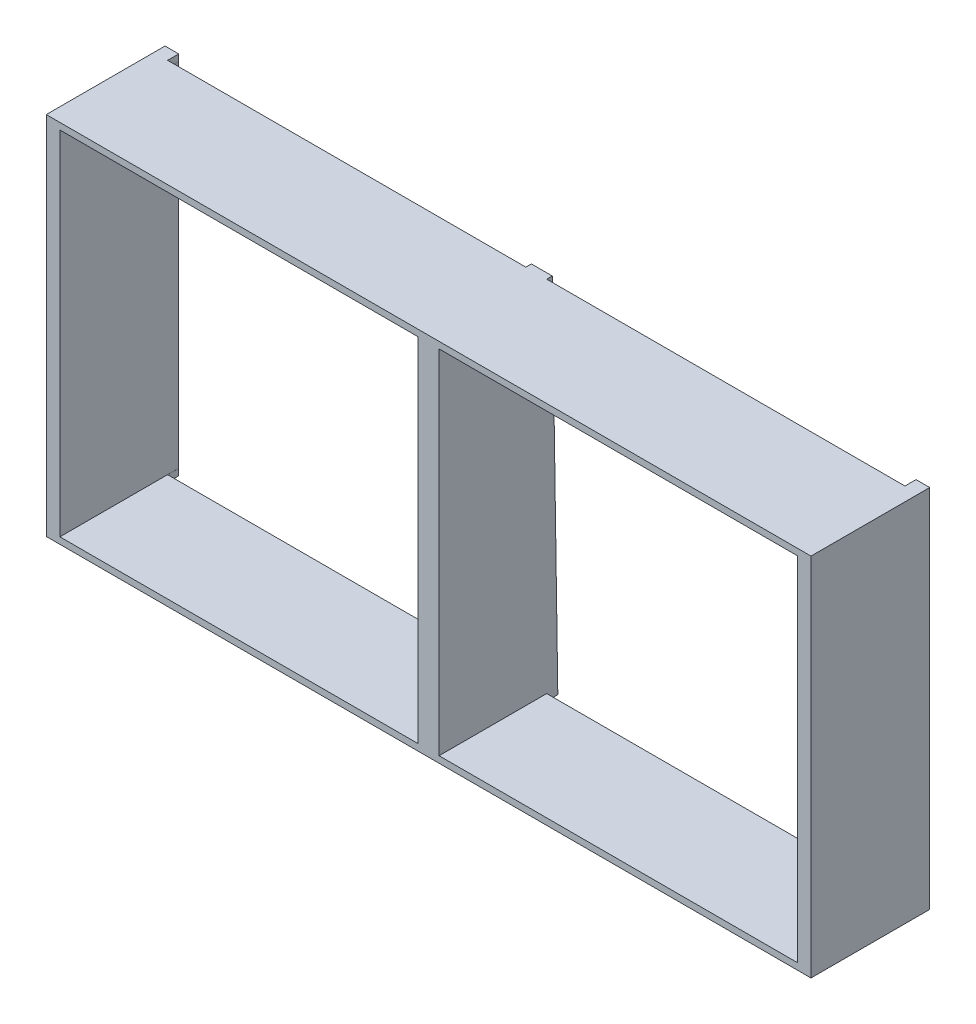
ISO-10303-21;
HEADER;
FILE_DESCRIPTION(('STEP AP214'),'2;1');
FILE_NAME('part.step','',(''),(''),'','','');
FILE_SCHEMA(('AUTOMOTIVE_DESIGN { 1 0 10303 214 1 1 1 1 }'));
ENDSEC;
DATA;
#1=APPLICATION_CONTEXT('core data for automotive mechanical design processes');
#2=APPLICATION_PROTOCOL_DEFINITION('international standard','automotive_design',2000,#1);
#3=PRODUCT_CONTEXT('',#1,'mechanical');
#4=PRODUCT('Part','Part','',(#3));
#5=PRODUCT_RELATED_PRODUCT_CATEGORY('part','',(#4));
#6=PRODUCT_DEFINITION_FORMATION('','',#4);
#7=PRODUCT_DEFINITION_CONTEXT('part definition',#1,'design');
#8=PRODUCT_DEFINITION('design','',#6,#7);
#9=PRODUCT_DEFINITION_SHAPE('','',#8);
#10=(LENGTH_UNIT() NAMED_UNIT(*) SI_UNIT(.MILLI.,.METRE.));
#11=(NAMED_UNIT(*) PLANE_ANGLE_UNIT() SI_UNIT($,.RADIAN.));
#12=(NAMED_UNIT(*) SI_UNIT($,.STERADIAN.) SOLID_ANGLE_UNIT());
#13=UNCERTAINTY_MEASURE_WITH_UNIT(LENGTH_MEASURE(1.E-05),#10,'distance_accuracy_value','');
#14=(GEOMETRIC_REPRESENTATION_CONTEXT(3) GLOBAL_UNCERTAINTY_ASSIGNED_CONTEXT((#13)) GLOBAL_UNIT_ASSIGNED_CONTEXT((#10,
#11,#12)) REPRESENTATION_CONTEXT('',''));
#15=CARTESIAN_POINT('',(0.,0.,0.));
#16=DIRECTION('',(0.,0.,1.));
#17=DIRECTION('',(1.,0.,0.));
#18=AXIS2_PLACEMENT_3D('',#15,#16,#17);
#19=CARTESIAN_POINT('',(0.,0.,0.));
#20=DIRECTION('',(0.,0.,1.));
#21=DIRECTION('',(1.,0.,0.));
#22=AXIS2_PLACEMENT_3D('',#19,#20,#21);
#23=PLANE('',#22);
#24=DIRECTION('',(1.,0.,0.));
#25=VECTOR('',#24,1.);
#26=CARTESIAN_POINT('',(-2930.,-1400.,0.));
#27=LINE('',#26,#25);
#28=CARTESIAN_POINT('',(2825.,-1400.,0.));
#29=VERTEX_POINT('',#28);
#30=CARTESIAN_POINT('',(2930.,-1400.,0.));
#31=VERTEX_POINT('',#30);
#32=EDGE_CURVE('E220',#29,#31,#27,.T.);
#33=ORIENTED_EDGE('',*,*,#32,.F.);
#34=DIRECTION('',(0.,-1.,0.));
#35=VECTOR('',#34,1.);
#36=CARTESIAN_POINT('',(2825.,1400.,0.));
#37=LINE('',#36,#35);
#38=CARTESIAN_POINT('',(2825.,-1350.,0.));
#39=VERTEX_POINT('',#38);
#40=EDGE_CURVE('E341',#39,#29,#37,.T.);
#41=ORIENTED_EDGE('',*,*,#40,.F.);
#42=DIRECTION('',(1.,0.,0.));
#43=VECTOR('',#42,1.);
#44=CARTESIAN_POINT('',(80.0000000000003,-1350.,0.));
#45=LINE('',#44,#43);
#46=CARTESIAN_POINT('',(2825.35714285714,-1350.,0.));
#47=VERTEX_POINT('',#46);
#48=EDGE_CURVE('E362',#39,#47,#45,.T.);
#49=ORIENTED_EDGE('',*,*,#48,.T.);
#50=DIRECTION('',(0.,1.,0.));
#51=VECTOR('',#50,1.);
#52=CARTESIAN_POINT('',(2825.35714285714,1350.,0.));
#53=LINE('',#52,#51);
#54=CARTESIAN_POINT('',(2825.35714285714,1350.,0.));
#55=VERTEX_POINT('',#54);
#56=EDGE_CURVE('E374',#47,#55,#53,.T.);
#57=ORIENTED_EDGE('',*,*,#56,.T.);
#58=DIRECTION('',(-1.,0.,0.));
#59=VECTOR('',#58,1.);
#60=CARTESIAN_POINT('',(80.,1350.,0.));
#61=LINE('',#60,#59);
#62=CARTESIAN_POINT('',(2825.,1350.,0.));
#63=VERTEX_POINT('',#62);
#64=EDGE_CURVE('E338',#55,#63,#61,.T.);
#65=ORIENTED_EDGE('',*,*,#64,.T.);
#66=CARTESIAN_POINT('',(2825.,1400.,0.));
#67=VERTEX_POINT('',#66);
#68=EDGE_CURVE('E335',#67,#63,#37,.T.);
#69=ORIENTED_EDGE('',*,*,#68,.F.);
#70=DIRECTION('',(-1.,0.,0.));
#71=VECTOR('',#70,1.);
#72=CARTESIAN_POINT('',(-2930.,1400.,0.));
#73=LINE('',#72,#71);
#74=CARTESIAN_POINT('',(2930.,1400.,0.));
#75=VERTEX_POINT('',#74);
#76=EDGE_CURVE('E304',#75,#67,#73,.T.);
#77=ORIENTED_EDGE('',*,*,#76,.F.);
#78=DIRECTION('',(0.,1.,0.));
#79=VECTOR('',#78,1.);
#80=CARTESIAN_POINT('',(2930.,1400.,0.));
#81=LINE('',#80,#79);
#82=EDGE_CURVE('E294',#31,#75,#81,.T.);
#83=ORIENTED_EDGE('',*,*,#82,.F.);
#84=EDGE_LOOP('',(#33,#41,#49,#57,#65,#69,#77,#83));
#85=FACE_BOUND('',#84,.T.);
#86=ADVANCED_FACE('F35',(#85),#23,.F.);
#87=CARTESIAN_POINT('',(0.,0.,910.000000000001));
#88=DIRECTION('',(0.,0.,1.));
#89=DIRECTION('',(1.,0.,0.));
#90=AXIS2_PLACEMENT_3D('',#87,#88,#89);
#91=PLANE('',#90);
#92=DIRECTION('',(0.,1.,0.));
#93=VECTOR('',#92,1.);
#94=CARTESIAN_POINT('',(2930.,1400.,910.000000000001));
#95=LINE('',#94,#93);
#96=CARTESIAN_POINT('',(2930.,-1400.,910.000000000001));
#97=VERTEX_POINT('',#96);
#98=CARTESIAN_POINT('',(2930.,1400.,910.000000000001));
#99=VERTEX_POINT('',#98);
#100=EDGE_CURVE('E223',#97,#99,#95,.T.);
#101=ORIENTED_EDGE('',*,*,#100,.T.);
#102=DIRECTION('',(-1.,0.,0.));
#103=VECTOR('',#102,1.);
#104=CARTESIAN_POINT('',(-2930.,1400.,910.000000000001));
#105=LINE('',#104,#103);
#106=CARTESIAN_POINT('',(-2930.,1400.,910.000000000001));
#107=VERTEX_POINT('',#106);
#108=EDGE_CURVE('E297',#99,#107,#105,.T.);
#109=ORIENTED_EDGE('',*,*,#108,.T.);
#110=DIRECTION('',(0.,-1.,0.));
#111=VECTOR('',#110,1.);
#112=CARTESIAN_POINT('',(-2930.,1400.,910.000000000001));
#113=LINE('',#112,#111);
#114=CARTESIAN_POINT('',(-2930.,-1400.,910.000000000001));
#115=VERTEX_POINT('',#114);
#116=EDGE_CURVE('E299',#107,#115,#113,.T.);
#117=ORIENTED_EDGE('',*,*,#116,.T.);
#118=DIRECTION('',(1.,0.,0.));
#119=VECTOR('',#118,1.);
#120=CARTESIAN_POINT('',(-2930.,-1400.,910.000000000001));
#121=LINE('',#120,#119);
#122=EDGE_CURVE('E232',#115,#97,#121,.T.);
#123=ORIENTED_EDGE('',*,*,#122,.T.);
#124=EDGE_LOOP('',(#101,#109,#117,#123));
#125=FACE_BOUND('',#124,.T.);
#126=DIRECTION('',(1.,0.,0.));
#127=VECTOR('',#126,1.);
#128=CARTESIAN_POINT('',(-2825.35714285714,-1350.,910.000000000001));
#129=LINE('',#128,#127);
#130=CARTESIAN_POINT('',(-2825.35714285714,-1350.,910.000000000001));
#131=VERTEX_POINT('',#130);
#132=CARTESIAN_POINT('',(-79.9999999999996,-1350.,910.000000000001));
#133=VERTEX_POINT('',#132);
#134=EDGE_CURVE('E277',#131,#133,#129,.T.);
#135=ORIENTED_EDGE('',*,*,#134,.F.);
#136=DIRECTION('',(0.,-1.,0.));
#137=VECTOR('',#136,1.);
#138=CARTESIAN_POINT('',(-2825.35714285714,1350.,910.000000000001));
#139=LINE('',#138,#137);
#140=CARTESIAN_POINT('',(-2825.35714285714,1350.,910.000000000001));
#141=VERTEX_POINT('',#140);
#142=EDGE_CURVE('E274',#141,#131,#139,.T.);
#143=ORIENTED_EDGE('',*,*,#142,.F.);
#144=DIRECTION('',(-1.,0.,0.));
#145=VECTOR('',#144,1.);
#146=CARTESIAN_POINT('',(-2825.35714285714,1350.,910.000000000001));
#147=LINE('',#146,#145);
#148=CARTESIAN_POINT('',(-80.0000000000001,1350.,910.000000000001));
#149=VERTEX_POINT('',#148);
#150=EDGE_CURVE('E286',#149,#141,#147,.T.);
#151=ORIENTED_EDGE('',*,*,#150,.F.);
#152=DIRECTION('',(0.,1.,0.));
#153=VECTOR('',#152,1.);
#154=CARTESIAN_POINT('',(-80.0000000000001,1350.,910.000000000001));
#155=LINE('',#154,#153);
#156=EDGE_CURVE('E387',#133,#149,#155,.T.);
#157=ORIENTED_EDGE('',*,*,#156,.F.);
#158=EDGE_LOOP('',(#135,#143,#151,#157));
#159=FACE_BOUND('',#158,.T.);
#160=DIRECTION('',(1.,0.,0.));
#161=VECTOR('',#160,1.);
#162=CARTESIAN_POINT('',(80.0000000000003,-1350.,910.000000000001));
#163=LINE('',#162,#161);
#164=CARTESIAN_POINT('',(80.0000000000003,-1350.,910.000000000001));
#165=VERTEX_POINT('',#164);
#166=CARTESIAN_POINT('',(2825.35714285714,-1350.,910.000000000001));
#167=VERTEX_POINT('',#166);
#168=EDGE_CURVE('E365',#165,#167,#163,.T.);
#169=ORIENTED_EDGE('',*,*,#168,.F.);
#170=DIRECTION('',(0.,-1.,0.));
#171=VECTOR('',#170,1.);
#172=CARTESIAN_POINT('',(80.,1350.,910.000000000001));
#173=LINE('',#172,#171);
#174=CARTESIAN_POINT('',(80.,1350.,910.000000000001));
#175=VERTEX_POINT('',#174);
#176=EDGE_CURVE('E363',#175,#165,#173,.T.);
#177=ORIENTED_EDGE('',*,*,#176,.F.);
#178=DIRECTION('',(-1.,0.,0.));
#179=VECTOR('',#178,1.);
#180=CARTESIAN_POINT('',(80.,1350.,910.000000000001));
#181=LINE('',#180,#179);
#182=CARTESIAN_POINT('',(2825.35714285714,1350.,910.000000000001));
#183=VERTEX_POINT('',#182);
#184=EDGE_CURVE('E370',#183,#175,#181,.T.);
#185=ORIENTED_EDGE('',*,*,#184,.F.);
#186=DIRECTION('',(0.,1.,0.));
#187=VECTOR('',#186,1.);
#188=CARTESIAN_POINT('',(2825.35714285714,1350.,910.000000000001));
#189=LINE('',#188,#187);
#190=EDGE_CURVE('E367',#167,#183,#189,.T.);
#191=ORIENTED_EDGE('',*,*,#190,.F.);
#192=EDGE_LOOP('',(#169,#177,#185,#191));
#193=FACE_BOUND('',#192,.T.);
#194=ADVANCED_FACE('F325',(#125,#159,#193),#91,.T.);
#195=CARTESIAN_POINT('',(-2825.,1400.,0.));
#196=VERTEX_POINT('',#195);
#197=CARTESIAN_POINT('',(-2930.,1400.,0.));
#198=VERTEX_POINT('',#197);
#199=EDGE_CURVE('E303',#196,#198,#73,.T.);
#200=ORIENTED_EDGE('',*,*,#199,.F.);
#201=DIRECTION('',(0.,-1.,0.));
#202=VECTOR('',#201,1.);
#203=CARTESIAN_POINT('',(-2825.,1400.,0.));
#204=LINE('',#203,#202);
#205=CARTESIAN_POINT('',(-2825.,1350.,0.));
#206=VERTEX_POINT('',#205);
#207=EDGE_CURVE('E356',#196,#206,#204,.T.);
#208=ORIENTED_EDGE('',*,*,#207,.T.);
#209=DIRECTION('',(-1.,0.,0.));
#210=VECTOR('',#209,1.);
#211=CARTESIAN_POINT('',(-2825.35714285714,1350.,0.));
#212=LINE('',#211,#210);
#213=CARTESIAN_POINT('',(-2825.35714285714,1350.,0.));
#214=VERTEX_POINT('',#213);
#215=EDGE_CURVE('E268',#206,#214,#212,.T.);
#216=ORIENTED_EDGE('',*,*,#215,.T.);
#217=DIRECTION('',(0.,-1.,0.));
#218=VECTOR('',#217,1.);
#219=CARTESIAN_POINT('',(-2825.35714285714,1350.,0.));
#220=LINE('',#219,#218);
#221=CARTESIAN_POINT('',(-2825.35714285714,-1350.,0.));
#222=VERTEX_POINT('',#221);
#223=EDGE_CURVE('E280',#214,#222,#220,.T.);
#224=ORIENTED_EDGE('',*,*,#223,.T.);
#225=DIRECTION('',(1.,0.,0.));
#226=VECTOR('',#225,1.);
#227=CARTESIAN_POINT('',(-2825.35714285714,-1350.,0.));
#228=LINE('',#227,#226);
#229=CARTESIAN_POINT('',(-2825.,-1350.,0.));
#230=VERTEX_POINT('',#229);
#231=EDGE_CURVE('E275',#222,#230,#228,.T.);
#232=ORIENTED_EDGE('',*,*,#231,.T.);
#233=CARTESIAN_POINT('',(-2825.,-1400.,0.));
#234=VERTEX_POINT('',#233);
#235=EDGE_CURVE('E263',#230,#234,#204,.T.);
#236=ORIENTED_EDGE('',*,*,#235,.T.);
#237=CARTESIAN_POINT('',(-2930.,-1400.,0.));
#238=VERTEX_POINT('',#237);
#239=EDGE_CURVE('E219',#238,#234,#27,.T.);
#240=ORIENTED_EDGE('',*,*,#239,.F.);
#241=DIRECTION('',(0.,-1.,0.));
#242=VECTOR('',#241,1.);
#243=CARTESIAN_POINT('',(-2930.,1400.,0.));
#244=LINE('',#243,#242);
#245=EDGE_CURVE('E224',#198,#238,#244,.T.);
#246=ORIENTED_EDGE('',*,*,#245,.F.);
#247=EDGE_LOOP('',(#200,#208,#216,#224,#232,#236,#240,#246));
#248=FACE_BOUND('',#247,.T.);
#249=ADVANCED_FACE('F317',(#248),#23,.F.);
#250=CARTESIAN_POINT('',(2930.,1400.,910.000000000001));
#251=DIRECTION('',(-1.,0.,0.));
#252=DIRECTION('',(0.,-1.,0.));
#253=AXIS2_PLACEMENT_3D('',#250,#251,#252);
#254=PLANE('',#253);
#255=ORIENTED_EDGE('',*,*,#82,.T.);
#256=DIRECTION('',(0.,0.,-1.));
#257=VECTOR('',#256,1.);
#258=CARTESIAN_POINT('',(2930.,1400.,910.000000000001));
#259=LINE('',#258,#257);
#260=EDGE_CURVE('E238',#99,#75,#259,.T.);
#261=ORIENTED_EDGE('',*,*,#260,.F.);
#262=ORIENTED_EDGE('',*,*,#100,.F.);
#263=DIRECTION('',(0.,0.,-1.));
#264=VECTOR('',#263,1.);
#265=CARTESIAN_POINT('',(2930.,-1400.,910.000000000001));
#266=LINE('',#265,#264);
#267=EDGE_CURVE('E228',#97,#31,#266,.T.);
#268=ORIENTED_EDGE('',*,*,#267,.T.);
#269=EDGE_LOOP('',(#255,#261,#262,#268));
#270=FACE_BOUND('',#269,.T.);
#271=ADVANCED_FACE('F37',(#270),#254,.F.);
#272=CARTESIAN_POINT('',(-2930.,1400.,910.000000000001));
#273=DIRECTION('',(0.,-1.,0.));
#274=DIRECTION('',(0.,0.,-1.));
#275=AXIS2_PLACEMENT_3D('',#272,#273,#274);
#276=PLANE('',#275);
#277=DIRECTION('',(0.,0.,-1.));
#278=VECTOR('',#277,1.);
#279=CARTESIAN_POINT('',(80.0000000000002,1400.,85.));
#280=LINE('',#279,#278);
#281=CARTESIAN_POINT('',(80.0000000000002,1400.,85.));
#282=VERTEX_POINT('',#281);
#283=CARTESIAN_POINT('',(80.0000000000001,1400.,42.5));
#284=VERTEX_POINT('',#283);
#285=EDGE_CURVE('E420',#282,#284,#280,.T.);
#286=ORIENTED_EDGE('',*,*,#285,.T.);
#287=DIRECTION('',(-1.,0.,0.));
#288=VECTOR('',#287,1.);
#289=CARTESIAN_POINT('',(2880.32252606731,1400.,42.5));
#290=LINE('',#289,#288);
#291=CARTESIAN_POINT('',(-80.0000000000001,1400.,42.5));
#292=VERTEX_POINT('',#291);
#293=EDGE_CURVE('E50',#284,#292,#290,.T.);
#294=ORIENTED_EDGE('',*,*,#293,.T.);
#295=DIRECTION('',(0.,0.,1.));
#296=VECTOR('',#295,1.);
#297=CARTESIAN_POINT('',(-80.0000000000001,1400.,85.));
#298=LINE('',#297,#296);
#299=CARTESIAN_POINT('',(-80.0000000000001,1400.,85.));
#300=VERTEX_POINT('',#299);
#301=EDGE_CURVE('E411',#292,#300,#298,.T.);
#302=ORIENTED_EDGE('',*,*,#301,.T.);
#303=DIRECTION('',(-1.,0.,0.));
#304=VECTOR('',#303,1.);
#305=CARTESIAN_POINT('',(-2825.,1400.,85.));
#306=LINE('',#305,#304);
#307=CARTESIAN_POINT('',(-2825.,1400.,85.));
#308=VERTEX_POINT('',#307);
#309=EDGE_CURVE('E646',#300,#308,#306,.T.);
#310=ORIENTED_EDGE('',*,*,#309,.T.);
#311=DIRECTION('',(0.,0.,-1.));
#312=VECTOR('',#311,1.);
#313=CARTESIAN_POINT('',(-2825.,1400.,85.));
#314=LINE('',#313,#312);
#315=EDGE_CURVE('E261',#308,#196,#314,.T.);
#316=ORIENTED_EDGE('',*,*,#315,.T.);
#317=ORIENTED_EDGE('',*,*,#199,.T.);
#318=DIRECTION('',(0.,0.,-1.));
#319=VECTOR('',#318,1.);
#320=CARTESIAN_POINT('',(-2930.,1400.,910.000000000001));
#321=LINE('',#320,#319);
#322=EDGE_CURVE('E235',#107,#198,#321,.T.);
#323=ORIENTED_EDGE('',*,*,#322,.F.);
#324=ORIENTED_EDGE('',*,*,#108,.F.);
#325=ORIENTED_EDGE('',*,*,#260,.T.);
#326=ORIENTED_EDGE('',*,*,#76,.T.);
#327=DIRECTION('',(0.,0.,1.));
#328=VECTOR('',#327,1.);
#329=CARTESIAN_POINT('',(2825.,1400.,85.0000000000007));
#330=LINE('',#329,#328);
#331=CARTESIAN_POINT('',(2825.,1400.,85.0000000000007));
#332=VERTEX_POINT('',#331);
#333=EDGE_CURVE('E211',#67,#332,#330,.T.);
#334=ORIENTED_EDGE('',*,*,#333,.T.);
#335=DIRECTION('',(-1.,0.,0.));
#336=VECTOR('',#335,1.);
#337=CARTESIAN_POINT('',(2825.,1400.,85.0000000000007));
#338=LINE('',#337,#336);
#339=EDGE_CURVE('E417',#332,#282,#338,.T.);
#340=ORIENTED_EDGE('',*,*,#339,.T.);
#341=EDGE_LOOP('',(#286,#294,#302,#310,#316,#317,#323,#324,#325,#326,#334,#340));
#342=FACE_BOUND('',#341,.T.);
#343=ADVANCED_FACE('F310',(#342),#276,.F.);
#344=CARTESIAN_POINT('',(-2930.,1400.,910.000000000001));
#345=DIRECTION('',(1.,0.,0.));
#346=DIRECTION('',(0.,1.,0.));
#347=AXIS2_PLACEMENT_3D('',#344,#345,#346);
#348=PLANE('',#347);
#349=ORIENTED_EDGE('',*,*,#245,.T.);
#350=DIRECTION('',(0.,0.,-1.));
#351=VECTOR('',#350,1.);
#352=CARTESIAN_POINT('',(-2930.,-1400.,910.000000000001));
#353=LINE('',#352,#351);
#354=EDGE_CURVE('E231',#115,#238,#353,.T.);
#355=ORIENTED_EDGE('',*,*,#354,.F.);
#356=ORIENTED_EDGE('',*,*,#116,.F.);
#357=ORIENTED_EDGE('',*,*,#322,.T.);
#358=EDGE_LOOP('',(#349,#355,#356,#357));
#359=FACE_BOUND('',#358,.T.);
#360=ADVANCED_FACE('F314',(#359),#348,.F.);
#361=CARTESIAN_POINT('',(-2930.,-1400.,910.000000000001));
#362=DIRECTION('',(0.,1.,0.));
#363=DIRECTION('',(0.,0.,1.));
#364=AXIS2_PLACEMENT_3D('',#361,#362,#363);
#365=PLANE('',#364);
#366=DIRECTION('',(-1.,0.,0.));
#367=VECTOR('',#366,1.);
#368=CARTESIAN_POINT('',(-2825.,-1400.,85.));
#369=LINE('',#368,#367);
#370=CARTESIAN_POINT('',(-80.0000000000001,-1400.,85.));
#371=VERTEX_POINT('',#370);
#372=CARTESIAN_POINT('',(-2825.,-1400.,85.));
#373=VERTEX_POINT('',#372);
#374=EDGE_CURVE('E343',#371,#373,#369,.T.);
#375=ORIENTED_EDGE('',*,*,#374,.F.);
#376=DIRECTION('',(0.,0.,1.));
#377=VECTOR('',#376,1.);
#378=CARTESIAN_POINT('',(-80.0000000000001,-1400.,85.));
#379=LINE('',#378,#377);
#380=CARTESIAN_POINT('',(-79.9999999999996,-1400.,0.));
#381=VERTEX_POINT('',#380);
#382=EDGE_CURVE('E218',#381,#371,#379,.T.);
#383=ORIENTED_EDGE('',*,*,#382,.F.);
#384=CARTESIAN_POINT('',(80.0000000000001,-1400.,0.));
#385=VERTEX_POINT('',#384);
#386=EDGE_CURVE('E196',#381,#385,#27,.T.);
#387=ORIENTED_EDGE('',*,*,#386,.T.);
#388=DIRECTION('',(0.,0.,-1.));
#389=VECTOR('',#388,1.);
#390=CARTESIAN_POINT('',(80.0000000000002,-1400.,85.));
#391=LINE('',#390,#389);
#392=CARTESIAN_POINT('',(80.0000000000002,-1400.,85.));
#393=VERTEX_POINT('',#392);
#394=EDGE_CURVE('E204',#393,#385,#391,.T.);
#395=ORIENTED_EDGE('',*,*,#394,.F.);
#396=DIRECTION('',(-1.,0.,0.));
#397=VECTOR('',#396,1.);
#398=CARTESIAN_POINT('',(2825.,-1400.,85.0000000000007));
#399=LINE('',#398,#397);
#400=CARTESIAN_POINT('',(2825.,-1400.,85.0000000000007));
#401=VERTEX_POINT('',#400);
#402=EDGE_CURVE('E212',#401,#393,#399,.T.);
#403=ORIENTED_EDGE('',*,*,#402,.F.);
#404=DIRECTION('',(0.,0.,1.));
#405=VECTOR('',#404,1.);
#406=CARTESIAN_POINT('',(2825.,-1400.,85.0000000000007));
#407=LINE('',#406,#405);
#408=EDGE_CURVE('E422',#29,#401,#407,.T.);
#409=ORIENTED_EDGE('',*,*,#408,.F.);
#410=ORIENTED_EDGE('',*,*,#32,.T.);
#411=ORIENTED_EDGE('',*,*,#267,.F.);
#412=ORIENTED_EDGE('',*,*,#122,.F.);
#413=ORIENTED_EDGE('',*,*,#354,.T.);
#414=ORIENTED_EDGE('',*,*,#239,.T.);
#415=DIRECTION('',(0.,0.,-1.));
#416=VECTOR('',#415,1.);
#417=CARTESIAN_POINT('',(-2825.,-1400.,85.));
#418=LINE('',#417,#416);
#419=EDGE_CURVE('E320',#373,#234,#418,.T.);
#420=ORIENTED_EDGE('',*,*,#419,.F.);
#421=EDGE_LOOP('',(#375,#383,#387,#395,#403,#409,#410,#411,#412,#413,#414,#420));
#422=FACE_BOUND('',#421,.T.);
#423=ADVANCED_FACE('F216',(#422),#365,.F.);
#424=CARTESIAN_POINT('',(-2825.35714285714,1350.,910.000000000001));
#425=DIRECTION('',(1.,0.,0.));
#426=DIRECTION('',(0.,0.,-1.));
#427=AXIS2_PLACEMENT_3D('',#424,#425,#426);
#428=PLANE('',#427);
#429=ORIENTED_EDGE('',*,*,#223,.F.);
#430=DIRECTION('',(0.,0.,-1.));
#431=VECTOR('',#430,1.);
#432=CARTESIAN_POINT('',(-2825.35714285714,1350.,910.000000000001));
#433=LINE('',#432,#431);
#434=EDGE_CURVE('E270',#141,#214,#433,.T.);
#435=ORIENTED_EDGE('',*,*,#434,.F.);
#436=ORIENTED_EDGE('',*,*,#142,.T.);
#437=DIRECTION('',(0.,0.,-1.));
#438=VECTOR('',#437,1.);
#439=CARTESIAN_POINT('',(-2825.35714285714,-1350.,910.000000000001));
#440=LINE('',#439,#438);
#441=EDGE_CURVE('E291',#131,#222,#440,.T.);
#442=ORIENTED_EDGE('',*,*,#441,.T.);
#443=EDGE_LOOP('',(#429,#435,#436,#442));
#444=FACE_BOUND('',#443,.T.);
#445=ADVANCED_FACE('F391',(#444),#428,.T.);
#446=CARTESIAN_POINT('',(-2825.35714285714,-1350.,910.000000000001));
#447=DIRECTION('',(0.,1.,0.));
#448=DIRECTION('',(0.,0.,1.));
#449=AXIS2_PLACEMENT_3D('',#446,#447,#448);
#450=PLANE('',#449);
#451=DIRECTION('',(0.,0.,1.));
#452=VECTOR('',#451,1.);
#453=CARTESIAN_POINT('',(-2825.,-1350.,910.000000000001));
#454=LINE('',#453,#452);
#455=CARTESIAN_POINT('',(-2825.,-1350.,85.));
#456=VERTEX_POINT('',#455);
#457=EDGE_CURVE('E360',#230,#456,#454,.T.);
#458=ORIENTED_EDGE('',*,*,#457,.F.);
#459=ORIENTED_EDGE('',*,*,#231,.F.);
#460=ORIENTED_EDGE('',*,*,#441,.F.);
#461=ORIENTED_EDGE('',*,*,#134,.T.);
#462=DIRECTION('',(0.,0.,-1.));
#463=VECTOR('',#462,1.);
#464=CARTESIAN_POINT('',(-79.9999999999996,-1350.,910.000000000001));
#465=LINE('',#464,#463);
#466=CARTESIAN_POINT('',(-80.0000000000001,-1350.,85.));
#467=VERTEX_POINT('',#466);
#468=EDGE_CURVE('E288',#133,#467,#465,.T.);
#469=ORIENTED_EDGE('',*,*,#468,.T.);
#470=DIRECTION('',(1.,0.,0.));
#471=VECTOR('',#470,1.);
#472=CARTESIAN_POINT('',(-2825.35714285714,-1350.,85.));
#473=LINE('',#472,#471);
#474=EDGE_CURVE('E358',#456,#467,#473,.T.);
#475=ORIENTED_EDGE('',*,*,#474,.F.);
#476=EDGE_LOOP('',(#458,#459,#460,#461,#469,#475));
#477=FACE_BOUND('',#476,.T.);
#478=ADVANCED_FACE('F397',(#477),#450,.T.);
#479=CARTESIAN_POINT('',(-80.0000000000001,1350.,910.000000000001));
#480=DIRECTION('',(-1.,0.,0.));
#481=DIRECTION('',(0.,-1.,0.));
#482=AXIS2_PLACEMENT_3D('',#479,#480,#481);
#483=PLANE('',#482);
#484=DIRECTION('',(0.,0.999884825385538,0.0151768232424591));
#485=VECTOR('',#484,1.);
#486=CARTESIAN_POINT('',(-79.9999999999996,-1400.,0.));
#487=LINE('',#486,#485);
#488=EDGE_CURVE('E201',#381,#292,#487,.T.);
#489=ORIENTED_EDGE('',*,*,#488,.F.);
#490=ORIENTED_EDGE('',*,*,#382,.T.);
#491=DIRECTION('',(0.,-1.,0.));
#492=VECTOR('',#491,1.);
#493=CARTESIAN_POINT('',(-80.0000000000001,1400.,85.));
#494=LINE('',#493,#492);
#495=EDGE_CURVE('E405',#467,#371,#494,.T.);
#496=ORIENTED_EDGE('',*,*,#495,.F.);
#497=ORIENTED_EDGE('',*,*,#468,.F.);
#498=ORIENTED_EDGE('',*,*,#156,.T.);
#499=DIRECTION('',(0.,0.,-1.));
#500=VECTOR('',#499,1.);
#501=CARTESIAN_POINT('',(-80.0000000000001,1350.,910.000000000001));
#502=LINE('',#501,#500);
#503=CARTESIAN_POINT('',(-80.0000000000001,1350.,85.0000000000002));
#504=VERTEX_POINT('',#503);
#505=EDGE_CURVE('E285',#149,#504,#502,.T.);
#506=ORIENTED_EDGE('',*,*,#505,.T.);
#507=EDGE_CURVE('E253',#300,#504,#494,.T.);
#508=ORIENTED_EDGE('',*,*,#507,.F.);
#509=ORIENTED_EDGE('',*,*,#301,.F.);
#510=EDGE_LOOP('',(#489,#490,#496,#497,#498,#506,#508,#509));
#511=FACE_BOUND('',#510,.T.);
#512=ADVANCED_FACE('F403',(#511),#483,.T.);
#513=CARTESIAN_POINT('',(-2825.35714285714,1350.,910.000000000001));
#514=DIRECTION('',(0.,-1.,0.));
#515=DIRECTION('',(0.,0.,-1.));
#516=AXIS2_PLACEMENT_3D('',#513,#514,#515);
#517=PLANE('',#516);
#518=DIRECTION('',(0.,0.,-1.));
#519=VECTOR('',#518,1.);
#520=CARTESIAN_POINT('',(-2825.,1350.,910.000000000001));
#521=LINE('',#520,#519);
#522=CARTESIAN_POINT('',(-2825.,1350.,85.));
#523=VERTEX_POINT('',#522);
#524=EDGE_CURVE('E11',#523,#206,#521,.T.);
#525=ORIENTED_EDGE('',*,*,#524,.F.);
#526=DIRECTION('',(-1.,0.,0.));
#527=VECTOR('',#526,1.);
#528=CARTESIAN_POINT('',(-2825.35714285714,1350.,85.));
#529=LINE('',#528,#527);
#530=EDGE_CURVE('E43',#504,#523,#529,.T.);
#531=ORIENTED_EDGE('',*,*,#530,.F.);
#532=ORIENTED_EDGE('',*,*,#505,.F.);
#533=ORIENTED_EDGE('',*,*,#150,.T.);
#534=ORIENTED_EDGE('',*,*,#434,.T.);
#535=ORIENTED_EDGE('',*,*,#215,.F.);
#536=EDGE_LOOP('',(#525,#531,#532,#533,#534,#535));
#537=FACE_BOUND('',#536,.T.);
#538=ADVANCED_FACE('F266',(#537),#517,.T.);
#539=CARTESIAN_POINT('',(80.,1350.,910.000000000001));
#540=DIRECTION('',(1.,0.,0.));
#541=DIRECTION('',(0.,1.,0.));
#542=AXIS2_PLACEMENT_3D('',#539,#540,#541);
#543=PLANE('',#542);
#544=DIRECTION('',(0.,0.999884825385538,0.0151768232424591));
#545=VECTOR('',#544,1.);
#546=CARTESIAN_POINT('',(80.0000000000005,-1400.,0.));
#547=LINE('',#546,#545);
#548=EDGE_CURVE('E192',#385,#284,#547,.T.);
#549=ORIENTED_EDGE('',*,*,#548,.T.);
#550=ORIENTED_EDGE('',*,*,#285,.F.);
#551=DIRECTION('',(0.,-1.,0.));
#552=VECTOR('',#551,1.);
#553=CARTESIAN_POINT('',(80.0000000000002,1400.,85.));
#554=LINE('',#553,#552);
#555=CARTESIAN_POINT('',(80.0000000000002,1350.,85.));
#556=VERTEX_POINT('',#555);
#557=EDGE_CURVE('E345',#282,#556,#554,.T.);
#558=ORIENTED_EDGE('',*,*,#557,.T.);
#559=DIRECTION('',(0.,0.,-1.));
#560=VECTOR('',#559,1.);
#561=CARTESIAN_POINT('',(80.,1350.,910.000000000001));
#562=LINE('',#561,#560);
#563=EDGE_CURVE('E372',#175,#556,#562,.T.);
#564=ORIENTED_EDGE('',*,*,#563,.F.);
#565=ORIENTED_EDGE('',*,*,#176,.T.);
#566=DIRECTION('',(0.,0.,-1.));
#567=VECTOR('',#566,1.);
#568=CARTESIAN_POINT('',(80.0000000000003,-1350.,910.000000000001));
#569=LINE('',#568,#567);
#570=CARTESIAN_POINT('',(80.0000000000003,-1350.,85.0000000000006));
#571=VERTEX_POINT('',#570);
#572=EDGE_CURVE('E384',#165,#571,#569,.T.);
#573=ORIENTED_EDGE('',*,*,#572,.T.);
#574=EDGE_CURVE('E207',#571,#393,#554,.T.);
#575=ORIENTED_EDGE('',*,*,#574,.T.);
#576=ORIENTED_EDGE('',*,*,#394,.T.);
#577=EDGE_LOOP('',(#549,#550,#558,#564,#565,#573,#575,#576));
#578=FACE_BOUND('',#577,.T.);
#579=ADVANCED_FACE('F205',(#578),#543,.T.);
#580=CARTESIAN_POINT('',(80.0000000000003,-1350.,910.000000000001));
#581=DIRECTION('',(0.,1.,0.));
#582=DIRECTION('',(0.,0.,1.));
#583=AXIS2_PLACEMENT_3D('',#580,#581,#582);
#584=PLANE('',#583);
#585=DIRECTION('',(0.,0.,-1.));
#586=VECTOR('',#585,1.);
#587=CARTESIAN_POINT('',(2825.,-1350.,910.000000000001));
#588=LINE('',#587,#586);
#589=CARTESIAN_POINT('',(2825.,-1350.,85.0000000000007));
#590=VERTEX_POINT('',#589);
#591=EDGE_CURVE('E355',#590,#39,#588,.T.);
#592=ORIENTED_EDGE('',*,*,#591,.F.);
#593=DIRECTION('',(1.,0.,0.));
#594=VECTOR('',#593,1.);
#595=CARTESIAN_POINT('',(80.0000000000005,-1350.,85.0000000000001));
#596=LINE('',#595,#594);
#597=EDGE_CURVE('E353',#571,#590,#596,.T.);
#598=ORIENTED_EDGE('',*,*,#597,.F.);
#599=ORIENTED_EDGE('',*,*,#572,.F.);
#600=ORIENTED_EDGE('',*,*,#168,.T.);
#601=DIRECTION('',(0.,0.,-1.));
#602=VECTOR('',#601,1.);
#603=CARTESIAN_POINT('',(2825.35714285714,-1350.,910.000000000001));
#604=LINE('',#603,#602);
#605=EDGE_CURVE('E381',#167,#47,#604,.T.);
#606=ORIENTED_EDGE('',*,*,#605,.T.);
#607=ORIENTED_EDGE('',*,*,#48,.F.);
#608=EDGE_LOOP('',(#592,#598,#599,#600,#606,#607));
#609=FACE_BOUND('',#608,.T.);
#610=ADVANCED_FACE('F434',(#609),#584,.T.);
#611=CARTESIAN_POINT('',(2825.35714285714,1350.,910.000000000001));
#612=DIRECTION('',(-1.,0.,0.));
#613=DIRECTION('',(0.,0.,1.));
#614=AXIS2_PLACEMENT_3D('',#611,#612,#613);
#615=PLANE('',#614);
#616=ORIENTED_EDGE('',*,*,#56,.F.);
#617=ORIENTED_EDGE('',*,*,#605,.F.);
#618=ORIENTED_EDGE('',*,*,#190,.T.);
#619=DIRECTION('',(0.,0.,-1.));
#620=VECTOR('',#619,1.);
#621=CARTESIAN_POINT('',(2825.35714285714,1350.,910.000000000001));
#622=LINE('',#621,#620);
#623=EDGE_CURVE('E379',#183,#55,#622,.T.);
#624=ORIENTED_EDGE('',*,*,#623,.T.);
#625=EDGE_LOOP('',(#616,#617,#618,#624));
#626=FACE_BOUND('',#625,.T.);
#627=ADVANCED_FACE('F441',(#626),#615,.T.);
#628=CARTESIAN_POINT('',(80.,1350.,910.000000000001));
#629=DIRECTION('',(0.,-1.,0.));
#630=DIRECTION('',(0.,0.,-1.));
#631=AXIS2_PLACEMENT_3D('',#628,#629,#630);
#632=PLANE('',#631);
#633=DIRECTION('',(0.,0.,1.));
#634=VECTOR('',#633,1.);
#635=CARTESIAN_POINT('',(2825.,1350.,910.000000000001));
#636=LINE('',#635,#634);
#637=CARTESIAN_POINT('',(2825.,1350.,85.0000000000008));
#638=VERTEX_POINT('',#637);
#639=EDGE_CURVE('E243',#63,#638,#636,.T.);
#640=ORIENTED_EDGE('',*,*,#639,.F.);
#641=ORIENTED_EDGE('',*,*,#64,.F.);
#642=ORIENTED_EDGE('',*,*,#623,.F.);
#643=ORIENTED_EDGE('',*,*,#184,.T.);
#644=ORIENTED_EDGE('',*,*,#563,.T.);
#645=DIRECTION('',(-1.,0.,0.));
#646=VECTOR('',#645,1.);
#647=CARTESIAN_POINT('',(80.0000000000002,1350.,85.0000000000001));
#648=LINE('',#647,#646);
#649=EDGE_CURVE('E241',#638,#556,#648,.T.);
#650=ORIENTED_EDGE('',*,*,#649,.F.);
#651=EDGE_LOOP('',(#640,#641,#642,#643,#644,#650));
#652=FACE_BOUND('',#651,.T.);
#653=ADVANCED_FACE('F444',(#652),#632,.T.);
#654=CARTESIAN_POINT('',(2825.,1400.,85.0000000000007));
#655=DIRECTION('',(0.,0.,1.));
#656=DIRECTION('',(1.,0.,0.));
#657=AXIS2_PLACEMENT_3D('',#654,#655,#656);
#658=PLANE('',#657);
#659=ORIENTED_EDGE('',*,*,#649,.T.);
#660=ORIENTED_EDGE('',*,*,#557,.F.);
#661=ORIENTED_EDGE('',*,*,#339,.F.);
#662=DIRECTION('',(0.,-1.,0.));
#663=VECTOR('',#662,1.);
#664=CARTESIAN_POINT('',(2825.,1400.,85.0000000000007));
#665=LINE('',#664,#663);
#666=EDGE_CURVE('E350',#332,#638,#665,.T.);
#667=ORIENTED_EDGE('',*,*,#666,.T.);
#668=EDGE_LOOP('',(#659,#660,#661,#667));
#669=FACE_BOUND('',#668,.T.);
#670=ADVANCED_FACE('F449',(#669),#658,.F.);
#671=CARTESIAN_POINT('',(2825.,1400.,85.0000000000007));
#672=DIRECTION('',(1.,0.,0.));
#673=DIRECTION('',(0.,0.,-1.));
#674=AXIS2_PLACEMENT_3D('',#671,#672,#673);
#675=PLANE('',#674);
#676=ORIENTED_EDGE('',*,*,#639,.T.);
#677=ORIENTED_EDGE('',*,*,#666,.F.);
#678=ORIENTED_EDGE('',*,*,#333,.F.);
#679=ORIENTED_EDGE('',*,*,#68,.T.);
#680=EDGE_LOOP('',(#676,#677,#678,#679));
#681=FACE_BOUND('',#680,.T.);
#682=ADVANCED_FACE('F446',(#681),#675,.F.);
#683=ORIENTED_EDGE('',*,*,#591,.T.);
#684=ORIENTED_EDGE('',*,*,#40,.T.);
#685=ORIENTED_EDGE('',*,*,#408,.T.);
#686=EDGE_CURVE('E352',#590,#401,#665,.T.);
#687=ORIENTED_EDGE('',*,*,#686,.F.);
#688=EDGE_LOOP('',(#683,#684,#685,#687));
#689=FACE_BOUND('',#688,.T.);
#690=ADVANCED_FACE('F430',(#689),#675,.F.);
#691=ORIENTED_EDGE('',*,*,#597,.T.);
#692=ORIENTED_EDGE('',*,*,#686,.T.);
#693=ORIENTED_EDGE('',*,*,#402,.T.);
#694=ORIENTED_EDGE('',*,*,#574,.F.);
#695=EDGE_LOOP('',(#691,#692,#693,#694));
#696=FACE_BOUND('',#695,.T.);
#697=ADVANCED_FACE('F425',(#696),#658,.F.);
#698=CARTESIAN_POINT('',(-2825.,1400.,85.));
#699=DIRECTION('',(0.,0.,1.));
#700=DIRECTION('',(1.,0.,0.));
#701=AXIS2_PLACEMENT_3D('',#698,#699,#700);
#702=PLANE('',#701);
#703=ORIENTED_EDGE('',*,*,#530,.T.);
#704=DIRECTION('',(0.,-1.,0.));
#705=VECTOR('',#704,1.);
#706=CARTESIAN_POINT('',(-2825.,1400.,85.));
#707=LINE('',#706,#705);
#708=EDGE_CURVE('E250',#308,#523,#707,.T.);
#709=ORIENTED_EDGE('',*,*,#708,.F.);
#710=ORIENTED_EDGE('',*,*,#309,.F.);
#711=ORIENTED_EDGE('',*,*,#507,.T.);
#712=EDGE_LOOP('',(#703,#709,#710,#711));
#713=FACE_BOUND('',#712,.T.);
#714=ADVANCED_FACE('F248',(#713),#702,.F.);
#715=CARTESIAN_POINT('',(-2825.,1400.,85.));
#716=DIRECTION('',(-1.,0.,0.));
#717=DIRECTION('',(0.,0.,1.));
#718=AXIS2_PLACEMENT_3D('',#715,#716,#717);
#719=PLANE('',#718);
#720=ORIENTED_EDGE('',*,*,#524,.T.);
#721=ORIENTED_EDGE('',*,*,#207,.F.);
#722=ORIENTED_EDGE('',*,*,#315,.F.);
#723=ORIENTED_EDGE('',*,*,#708,.T.);
#724=EDGE_LOOP('',(#720,#721,#722,#723));
#725=FACE_BOUND('',#724,.T.);
#726=ADVANCED_FACE('F258',(#725),#719,.F.);
#727=ORIENTED_EDGE('',*,*,#457,.T.);
#728=EDGE_CURVE('E58',#456,#373,#707,.T.);
#729=ORIENTED_EDGE('',*,*,#728,.T.);
#730=ORIENTED_EDGE('',*,*,#419,.T.);
#731=ORIENTED_EDGE('',*,*,#235,.F.);
#732=EDGE_LOOP('',(#727,#729,#730,#731));
#733=FACE_BOUND('',#732,.T.);
#734=ADVANCED_FACE('F568',(#733),#719,.F.);
#735=ORIENTED_EDGE('',*,*,#474,.T.);
#736=ORIENTED_EDGE('',*,*,#495,.T.);
#737=ORIENTED_EDGE('',*,*,#374,.T.);
#738=ORIENTED_EDGE('',*,*,#728,.F.);
#739=EDGE_LOOP('',(#735,#736,#737,#738));
#740=FACE_BOUND('',#739,.T.);
#741=ADVANCED_FACE('F407',(#740),#702,.F.);
#742=CARTESIAN_POINT('',(2880.32252606731,-1400.,0.));
#743=DIRECTION('',(0.,-0.0151768232424591,0.999884825385538));
#744=DIRECTION('',(0.,-0.999884825385538,-0.0151768232424591));
#745=AXIS2_PLACEMENT_3D('',#742,#743,#744);
#746=PLANE('',#745);
#747=ORIENTED_EDGE('',*,*,#386,.F.);
#748=ORIENTED_EDGE('',*,*,#488,.T.);
#749=ORIENTED_EDGE('',*,*,#293,.F.);
#750=ORIENTED_EDGE('',*,*,#548,.F.);
#751=EDGE_LOOP('',(#747,#748,#749,#750));
#752=FACE_BOUND('',#751,.T.);
#753=ADVANCED_FACE('F194',(#752),#746,.F.);
#754=CLOSED_SHELL('',(#86,#194,#249,#271,#343,#360,#423,#445,#478,#512,#538,#579,#610,#627,#653,
#670,#682,#690,#697,#714,#726,#734,#741,#753));
#755=MANIFOLD_SOLID_BREP('B2',#754);
#756=ADVANCED_BREP_SHAPE_REPRESENTATION('',(#18,#755),#14);
#757=SHAPE_DEFINITION_REPRESENTATION(#9,#756);
ENDSEC;
END-ISO-10303-21;
